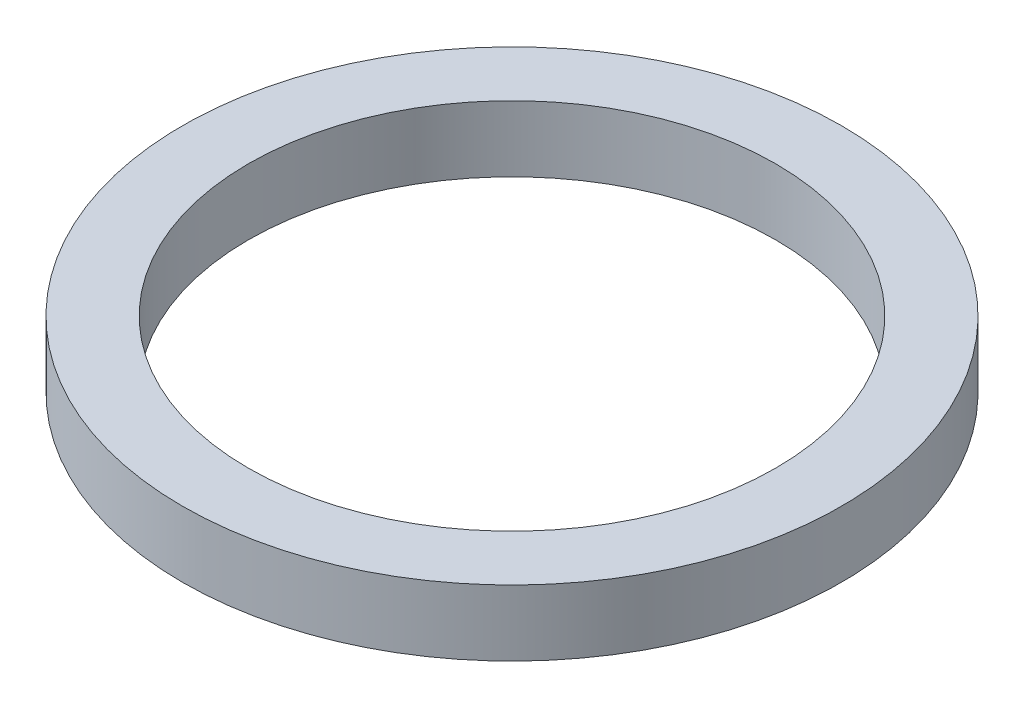
ISO-10303-21;
HEADER;
FILE_DESCRIPTION(('STEP AP214'),'2;1');
FILE_NAME('part.step','',(''),(''),'','','');
FILE_SCHEMA(('AUTOMOTIVE_DESIGN { 1 0 10303 214 1 1 1 1 }'));
ENDSEC;
DATA;
#1=APPLICATION_CONTEXT('core data for automotive mechanical design processes');
#2=APPLICATION_PROTOCOL_DEFINITION('international standard','automotive_design',2000,#1);
#3=PRODUCT_CONTEXT('',#1,'mechanical');
#4=PRODUCT('Part','Part','',(#3));
#5=PRODUCT_RELATED_PRODUCT_CATEGORY('part','',(#4));
#6=PRODUCT_DEFINITION_FORMATION('','',#4);
#7=PRODUCT_DEFINITION_CONTEXT('part definition',#1,'design');
#8=PRODUCT_DEFINITION('design','',#6,#7);
#9=PRODUCT_DEFINITION_SHAPE('','',#8);
#10=(LENGTH_UNIT() NAMED_UNIT(*) SI_UNIT(.MILLI.,.METRE.));
#11=(NAMED_UNIT(*) PLANE_ANGLE_UNIT() SI_UNIT($,.RADIAN.));
#12=(NAMED_UNIT(*) SI_UNIT($,.STERADIAN.) SOLID_ANGLE_UNIT());
#13=UNCERTAINTY_MEASURE_WITH_UNIT(LENGTH_MEASURE(1.E-05),#10,'distance_accuracy_value','');
#14=(GEOMETRIC_REPRESENTATION_CONTEXT(3) GLOBAL_UNCERTAINTY_ASSIGNED_CONTEXT((#13)) GLOBAL_UNIT_ASSIGNED_CONTEXT((#10,
#11,#12)) REPRESENTATION_CONTEXT('',''));
#15=CARTESIAN_POINT('',(0.,0.,0.));
#16=DIRECTION('',(0.,0.,1.));
#17=DIRECTION('',(1.,0.,0.));
#18=AXIS2_PLACEMENT_3D('',#15,#16,#17);
#19=CARTESIAN_POINT('',(0.,3.175,0.));
#20=DIRECTION('',(0.,1.,0.));
#21=DIRECTION('',(0.,0.,1.));
#22=AXIS2_PLACEMENT_3D('',#19,#20,#21);
#23=PLANE('',#22);
#24=CARTESIAN_POINT('',(0.,3.175,0.));
#25=DIRECTION('',(0.,1.,0.));
#26=DIRECTION('',(0.,0.,1.));
#27=AXIS2_PLACEMENT_3D('',#24,#25,#26);
#28=CIRCLE('',#27,15.875);
#29=CARTESIAN_POINT('',(0.,3.175,15.875));
#30=VERTEX_POINT('',#29);
#31=EDGE_CURVE('E10',#30,#30,#28,.T.);
#32=ORIENTED_EDGE('',*,*,#31,.T.);
#33=EDGE_LOOP('',(#32));
#34=FACE_BOUND('',#33,.T.);
#35=CARTESIAN_POINT('',(0.,3.175,0.));
#36=DIRECTION('',(0.,1.,0.));
#37=DIRECTION('',(0.,0.,1.));
#38=AXIS2_PLACEMENT_3D('',#35,#36,#37);
#39=CIRCLE('',#38,12.7);
#40=CARTESIAN_POINT('',(0.,3.175,12.7));
#41=VERTEX_POINT('',#40);
#42=EDGE_CURVE('E46',#41,#41,#39,.T.);
#43=ORIENTED_EDGE('',*,*,#42,.F.);
#44=EDGE_LOOP('',(#43));
#45=FACE_BOUND('',#44,.T.);
#46=ADVANCED_FACE('F35',(#34,#45),#23,.T.);
#47=CARTESIAN_POINT('',(0.,0.,0.));
#48=DIRECTION('',(0.,1.,0.));
#49=DIRECTION('',(0.,0.,1.));
#50=AXIS2_PLACEMENT_3D('',#47,#48,#49);
#51=PLANE('',#50);
#52=CARTESIAN_POINT('',(0.,0.,0.));
#53=DIRECTION('',(0.,1.,0.));
#54=DIRECTION('',(0.,0.,1.));
#55=AXIS2_PLACEMENT_3D('',#52,#53,#54);
#56=CIRCLE('',#55,15.875);
#57=CARTESIAN_POINT('',(0.,0.,15.875));
#58=VERTEX_POINT('',#57);
#59=EDGE_CURVE('E39',#58,#58,#56,.T.);
#60=ORIENTED_EDGE('',*,*,#59,.F.);
#61=EDGE_LOOP('',(#60));
#62=FACE_BOUND('',#61,.T.);
#63=CARTESIAN_POINT('',(0.,0.,0.));
#64=DIRECTION('',(0.,1.,0.));
#65=DIRECTION('',(0.,0.,1.));
#66=AXIS2_PLACEMENT_3D('',#63,#64,#65);
#67=CIRCLE('',#66,12.7);
#68=CARTESIAN_POINT('',(0.,0.,12.7));
#69=VERTEX_POINT('',#68);
#70=EDGE_CURVE('E48',#69,#69,#67,.T.);
#71=ORIENTED_EDGE('',*,*,#70,.T.);
#72=EDGE_LOOP('',(#71));
#73=FACE_BOUND('',#72,.T.);
#74=ADVANCED_FACE('F58',(#62,#73),#51,.F.);
#75=CARTESIAN_POINT('',(0.,3.175,0.));
#76=DIRECTION('',(0.,-1.,0.));
#77=DIRECTION('',(0.,0.,-1.));
#78=AXIS2_PLACEMENT_3D('',#75,#76,#77);
#79=CYLINDRICAL_SURFACE('',#78,15.875);
#80=ORIENTED_EDGE('',*,*,#31,.F.);
#81=EDGE_LOOP('',(#80));
#82=FACE_BOUND('',#81,.T.);
#83=ORIENTED_EDGE('',*,*,#59,.T.);
#84=EDGE_LOOP('',(#83));
#85=FACE_BOUND('',#84,.T.);
#86=ADVANCED_FACE('F37',(#82,#85),#79,.T.);
#87=CARTESIAN_POINT('',(0.,3.175,0.));
#88=DIRECTION('',(0.,-1.,0.));
#89=DIRECTION('',(0.,0.,-1.));
#90=AXIS2_PLACEMENT_3D('',#87,#88,#89);
#91=CYLINDRICAL_SURFACE('',#90,12.7);
#92=ORIENTED_EDGE('',*,*,#42,.T.);
#93=EDGE_LOOP('',(#92));
#94=FACE_BOUND('',#93,.T.);
#95=ORIENTED_EDGE('',*,*,#70,.F.);
#96=EDGE_LOOP('',(#95));
#97=FACE_BOUND('',#96,.T.);
#98=ADVANCED_FACE('F54',(#94,#97),#91,.F.);
#99=CLOSED_SHELL('',(#46,#74,#86,#98));
#100=MANIFOLD_SOLID_BREP('B2',#99);
#101=ADVANCED_BREP_SHAPE_REPRESENTATION('',(#18,#100),#14);
#102=SHAPE_DEFINITION_REPRESENTATION(#9,#101);
ENDSEC;
END-ISO-10303-21;
